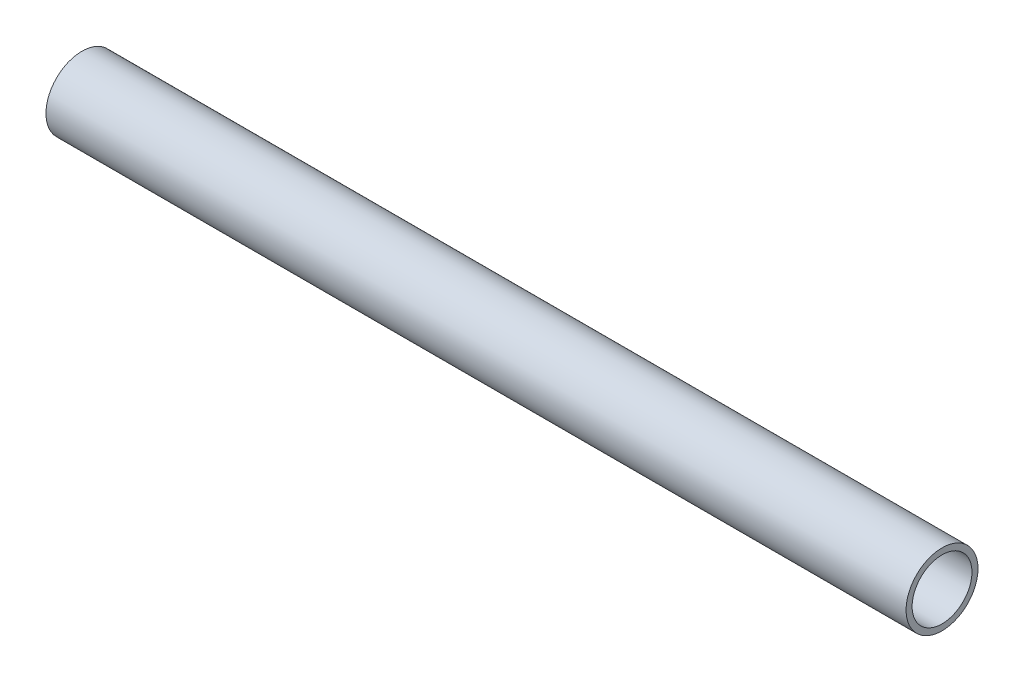
ISO-10303-21;
HEADER;
FILE_DESCRIPTION(('STEP AP214'),'2;1');
FILE_NAME('part.step','',(''),(''),'','','');
FILE_SCHEMA(('AUTOMOTIVE_DESIGN { 1 0 10303 214 1 1 1 1 }'));
ENDSEC;
DATA;
#1=APPLICATION_CONTEXT('core data for automotive mechanical design processes');
#2=APPLICATION_PROTOCOL_DEFINITION('international standard','automotive_design',2000,#1);
#3=PRODUCT_CONTEXT('',#1,'mechanical');
#4=PRODUCT('Part','Part','',(#3));
#5=PRODUCT_RELATED_PRODUCT_CATEGORY('part','',(#4));
#6=PRODUCT_DEFINITION_FORMATION('','',#4);
#7=PRODUCT_DEFINITION_CONTEXT('part definition',#1,'design');
#8=PRODUCT_DEFINITION('design','',#6,#7);
#9=PRODUCT_DEFINITION_SHAPE('','',#8);
#10=(LENGTH_UNIT() NAMED_UNIT(*) SI_UNIT(.MILLI.,.METRE.));
#11=(NAMED_UNIT(*) PLANE_ANGLE_UNIT() SI_UNIT($,.RADIAN.));
#12=(NAMED_UNIT(*) SI_UNIT($,.STERADIAN.) SOLID_ANGLE_UNIT());
#13=UNCERTAINTY_MEASURE_WITH_UNIT(LENGTH_MEASURE(1.E-05),#10,'distance_accuracy_value','');
#14=(GEOMETRIC_REPRESENTATION_CONTEXT(3) GLOBAL_UNCERTAINTY_ASSIGNED_CONTEXT((#13)) GLOBAL_UNIT_ASSIGNED_CONTEXT((#10,
#11,#12)) REPRESENTATION_CONTEXT('',''));
#15=CARTESIAN_POINT('',(0.,0.,0.));
#16=DIRECTION('',(0.,0.,1.));
#17=DIRECTION('',(1.,0.,0.));
#18=AXIS2_PLACEMENT_3D('',#15,#16,#17);
#19=CARTESIAN_POINT('',(-128.002810334742,1290.66626476834,0.));
#20=DIRECTION('',(-1.,0.,0.));
#21=DIRECTION('',(0.,0.,1.));
#22=AXIS2_PLACEMENT_3D('',#19,#20,#21);
#23=CYLINDRICAL_SURFACE('',#22,5.28319999999993);
#24=CARTESIAN_POINT('',(-128.002810334742,1290.66626476834,0.));
#25=DIRECTION('',(1.,0.,0.));
#26=DIRECTION('',(0.,0.,-1.));
#27=AXIS2_PLACEMENT_3D('',#24,#25,#26);
#28=CIRCLE('',#27,5.28319999999993);
#29=CARTESIAN_POINT('',(-128.002810334742,1290.66626476834,-5.28319999999993));
#30=VERTEX_POINT('',#29);
#31=EDGE_CURVE('E44',#30,#30,#28,.T.);
#32=ORIENTED_EDGE('',*,*,#31,.T.);
#33=EDGE_LOOP('',(#32));
#34=FACE_BOUND('',#33,.T.);
#35=CARTESIAN_POINT('',(-279.871714350143,1290.66626476834,0.));
#36=DIRECTION('',(1.,0.,0.));
#37=DIRECTION('',(0.,0.,-1.));
#38=AXIS2_PLACEMENT_3D('',#35,#36,#37);
#39=CIRCLE('',#38,5.28319999999993);
#40=CARTESIAN_POINT('',(-279.871714350143,1290.66626476834,-5.28319999999993));
#41=VERTEX_POINT('',#40);
#42=EDGE_CURVE('E50',#41,#41,#39,.T.);
#43=ORIENTED_EDGE('',*,*,#42,.F.);
#44=EDGE_LOOP('',(#43));
#45=FACE_BOUND('',#44,.T.);
#46=ADVANCED_FACE('F37',(#34,#45),#23,.F.);
#47=CARTESIAN_POINT('',(-128.002810334742,1290.66626476834,0.));
#48=DIRECTION('',(-1.,0.,0.));
#49=DIRECTION('',(0.,0.,1.));
#50=AXIS2_PLACEMENT_3D('',#47,#48,#49);
#51=CYLINDRICAL_SURFACE('',#50,6.34999999999994);
#52=CARTESIAN_POINT('',(-128.002810334742,1290.66626476834,0.));
#53=DIRECTION('',(1.,0.,0.));
#54=DIRECTION('',(0.,0.,-1.));
#55=AXIS2_PLACEMENT_3D('',#52,#53,#54);
#56=CIRCLE('',#55,6.34999999999994);
#57=CARTESIAN_POINT('',(-128.002810334742,1290.66626476834,-6.34999999999994));
#58=VERTEX_POINT('',#57);
#59=EDGE_CURVE('E11',#58,#58,#56,.T.);
#60=ORIENTED_EDGE('',*,*,#59,.F.);
#61=EDGE_LOOP('',(#60));
#62=FACE_BOUND('',#61,.T.);
#63=CARTESIAN_POINT('',(-279.871714350143,1290.66626476834,0.));
#64=DIRECTION('',(1.,0.,0.));
#65=DIRECTION('',(0.,0.,-1.));
#66=AXIS2_PLACEMENT_3D('',#63,#64,#65);
#67=CIRCLE('',#66,6.34999999999994);
#68=CARTESIAN_POINT('',(-279.871714350143,1290.66626476834,-6.34999999999994));
#69=VERTEX_POINT('',#68);
#70=EDGE_CURVE('E40',#69,#69,#67,.T.);
#71=ORIENTED_EDGE('',*,*,#70,.T.);
#72=EDGE_LOOP('',(#71));
#73=FACE_BOUND('',#72,.T.);
#74=ADVANCED_FACE('F57',(#62,#73),#51,.T.);
#75=CARTESIAN_POINT('',(-128.002810334742,1290.66626476834,0.));
#76=DIRECTION('',(1.,0.,0.));
#77=DIRECTION('',(0.,0.,-1.));
#78=AXIS2_PLACEMENT_3D('',#75,#76,#77);
#79=PLANE('',#78);
#80=ORIENTED_EDGE('',*,*,#31,.F.);
#81=EDGE_LOOP('',(#80));
#82=FACE_BOUND('',#81,.T.);
#83=ORIENTED_EDGE('',*,*,#59,.T.);
#84=EDGE_LOOP('',(#83));
#85=FACE_BOUND('',#84,.T.);
#86=ADVANCED_FACE('F61',(#82,#85),#79,.T.);
#87=CARTESIAN_POINT('',(-279.871714350143,1290.66626476834,0.));
#88=DIRECTION('',(1.,0.,0.));
#89=DIRECTION('',(0.,0.,-1.));
#90=AXIS2_PLACEMENT_3D('',#87,#88,#89);
#91=PLANE('',#90);
#92=ORIENTED_EDGE('',*,*,#42,.T.);
#93=EDGE_LOOP('',(#92));
#94=FACE_BOUND('',#93,.T.);
#95=ORIENTED_EDGE('',*,*,#70,.F.);
#96=EDGE_LOOP('',(#95));
#97=FACE_BOUND('',#96,.T.);
#98=ADVANCED_FACE('F59',(#94,#97),#91,.F.);
#99=CLOSED_SHELL('',(#46,#74,#86,#98));
#100=MANIFOLD_SOLID_BREP('B2',#99);
#101=ADVANCED_BREP_SHAPE_REPRESENTATION('',(#18,#100),#14);
#102=SHAPE_DEFINITION_REPRESENTATION(#9,#101);
ENDSEC;
END-ISO-10303-21;
